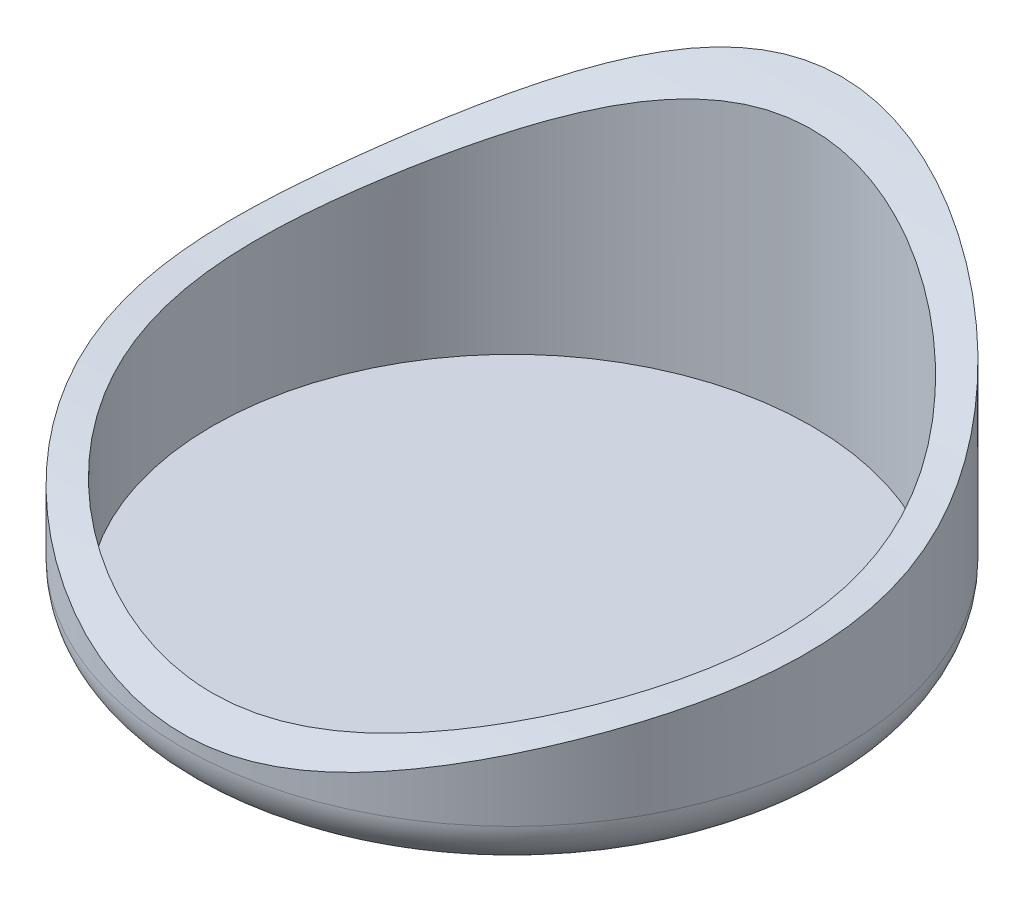
ISO-10303-21;
HEADER;
FILE_DESCRIPTION(('STEP AP214'),'2;1');
FILE_NAME('part.step','',(''),(''),'','','');
FILE_SCHEMA(('AUTOMOTIVE_DESIGN { 1 0 10303 214 1 1 1 1 }'));
ENDSEC;
DATA;
#1=APPLICATION_CONTEXT('core data for automotive mechanical design processes');
#2=APPLICATION_PROTOCOL_DEFINITION('international standard','automotive_design',2000,#1);
#3=PRODUCT_CONTEXT('',#1,'mechanical');
#4=PRODUCT('Part','Part','',(#3));
#5=PRODUCT_RELATED_PRODUCT_CATEGORY('part','',(#4));
#6=PRODUCT_DEFINITION_FORMATION('','',#4);
#7=PRODUCT_DEFINITION_CONTEXT('part definition',#1,'design');
#8=PRODUCT_DEFINITION('design','',#6,#7);
#9=PRODUCT_DEFINITION_SHAPE('','',#8);
#10=(LENGTH_UNIT() NAMED_UNIT(*) SI_UNIT(.MILLI.,.METRE.));
#11=(NAMED_UNIT(*) PLANE_ANGLE_UNIT() SI_UNIT($,.RADIAN.));
#12=(NAMED_UNIT(*) SI_UNIT($,.STERADIAN.) SOLID_ANGLE_UNIT());
#13=UNCERTAINTY_MEASURE_WITH_UNIT(LENGTH_MEASURE(1.E-05),#10,'distance_accuracy_value','');
#14=(GEOMETRIC_REPRESENTATION_CONTEXT(3) GLOBAL_UNCERTAINTY_ASSIGNED_CONTEXT((#13)) GLOBAL_UNIT_ASSIGNED_CONTEXT((#10,
#11,#12)) REPRESENTATION_CONTEXT('',''));
#15=CARTESIAN_POINT('',(0.,0.,0.));
#16=DIRECTION('',(0.,0.,1.));
#17=DIRECTION('',(1.,0.,0.));
#18=AXIS2_PLACEMENT_3D('',#15,#16,#17);
#19=CARTESIAN_POINT('',(0.,50.,0.));
#20=DIRECTION('',(0.,-1.,0.));
#21=DIRECTION('',(0.,0.,-1.));
#22=AXIS2_PLACEMENT_3D('',#19,#20,#21);
#23=CYLINDRICAL_SURFACE('',#22,55.);
#24=CARTESIAN_POINT('',(0.,8.,0.));
#25=DIRECTION('',(0.,1.,0.));
#26=DIRECTION('',(0.,0.,1.));
#27=AXIS2_PLACEMENT_3D('',#24,#25,#26);
#28=CIRCLE('',#27,55.);
#29=CARTESIAN_POINT('',(0.,8.,55.));
#30=VERTEX_POINT('',#29);
#31=EDGE_CURVE('E46',#30,#30,#28,.T.);
#32=ORIENTED_EDGE('',*,*,#31,.T.);
#33=EDGE_LOOP('',(#32));
#34=FACE_BOUND('',#33,.T.);
#35=CARTESIAN_POINT('',(0.,50.,-55.));
#36=CARTESIAN_POINT('',(0.854069115870392,49.999992625064,-54.999996191035));
#37=CARTESIAN_POINT('',(1.70831991411207,49.9777660004917,-54.9800787541194));
#38=CARTESIAN_POINT('',(3.41334942915672,49.8893770497818,-54.9006224824721));
#39=CARTESIAN_POINT('',(4.26412433642764,49.8231752633585,-54.841048062189));
#40=CARTESIAN_POINT('',(5.95779429608254,49.6484593647357,-54.6829784318823));
#41=CARTESIAN_POINT('',(6.80068813200412,49.5399388274347,-54.5844773117295));
#42=CARTESIAN_POINT('',(8.47782313889633,49.2827400179095,-54.3492966156558));
#43=CARTESIAN_POINT('',(9.3120260083913,49.1339288333599,-54.2124906262402));
#44=CARTESIAN_POINT('',(10.9659494369971,48.7996377199141,-53.9022803897119));
#45=CARTESIAN_POINT('',(11.7856723668956,48.614163855537,-53.7288821951405));
#46=CARTESIAN_POINT('',(13.4085593895451,48.2102646362606,-53.3470286634495));
#47=CARTESIAN_POINT('',(14.2117243581065,47.9918410293012,-53.1385751858987));
#48=CARTESIAN_POINT('',(15.7887838466717,47.5292334930132,-52.6913338226463));
#49=CARTESIAN_POINT('',(16.5629312999914,47.2854557145141,-52.4530145337054));
#50=CARTESIAN_POINT('',(18.0926250884293,46.7734391035743,-51.9452249696853));
#51=CARTESIAN_POINT('',(18.8481718760874,46.505200866986,-51.6757554533771));
#52=CARTESIAN_POINT('',(20.3400530494131,45.9479155637186,-51.1069426391914));
#53=CARTESIAN_POINT('',(21.0763875245413,45.6588685939571,-50.8075994804492));
#54=CARTESIAN_POINT('',(22.5292795771078,45.0635328202285,-50.1802502672315));
#55=CARTESIAN_POINT('',(23.245842999863,44.7572491954778,-49.852252806522));
#56=CARTESIAN_POINT('',(24.6592448740862,44.1306319009409,-49.1684650043946));
#57=CARTESIAN_POINT('',(25.3560839326998,43.8102986643984,-48.8126755197273));
#58=CARTESIAN_POINT('',(26.7300087740181,43.1586083349445,-48.074057042306));
#59=CARTESIAN_POINT('',(27.4070929768283,42.8272503648413,-47.6912258952254));
#60=CARTESIAN_POINT('',(29.2782875914583,41.8864853357786,-46.5804967297862));
#61=CARTESIAN_POINT('',(30.4501953752545,41.2678171093686,-45.8227342224061));
#62=CARTESIAN_POINT('',(32.7291915196127,40.0191745639058,-44.2237264055906));
#63=CARTESIAN_POINT('',(33.8362728200181,39.3891990231155,-43.3824720299668));
#64=CARTESIAN_POINT('',(35.9851198478277,38.1312499868894,-41.6173698903432));
#65=CARTESIAN_POINT('',(37.0268453400482,37.5032779463146,-40.6934720809734));
#66=CARTESIAN_POINT('',(39.0419273486149,36.2624289680221,-38.764326917331));
#67=CARTESIAN_POINT('',(40.0152851338796,35.6495517502787,-37.7590810736399));
#68=CARTESIAN_POINT('',(41.5892878261699,34.6431545535262,-36.0033498045493));
#69=CARTESIAN_POINT('',(42.2094213239966,34.2422732776303,-35.2744453649962));
#70=CARTESIAN_POINT('',(43.41478814514,33.4567419740657,-33.7798430810105));
#71=CARTESIAN_POINT('',(44.000021155523,33.072092091944,-33.0141449067797));
#72=CARTESIAN_POINT('',(45.1336837158256,32.3226652097743,-31.4465613871079));
#73=CARTESIAN_POINT('',(45.6821123756887,31.9578886903731,-30.6446751672985));
#74=CARTESIAN_POINT('',(46.739243682609,31.2522636957342,-29.0067535371727));
#75=CARTESIAN_POINT('',(47.2480013361252,30.9113821573175,-28.1707679507125));
#76=CARTESIAN_POINT('',(48.2242394638017,30.2563931325486,-26.4648544639774));
#77=CARTESIAN_POINT('',(48.6917206325427,29.9422851956661,-25.5949271352134));
#78=CARTESIAN_POINT('',(49.5827905112773,29.3442086791091,-23.8228880684401));
#79=CARTESIAN_POINT('',(50.0063826114807,29.0602377714592,-22.9207788235696));
#80=CARTESIAN_POINT('',(50.8084269172449,28.5207954417795,-21.0834732261368));
#81=CARTESIAN_POINT('',(51.1866780361525,28.2654512808639,-20.1481517191868));
#82=CARTESIAN_POINT('',(51.8932263361902,27.7833520468131,-18.251500813062));
#83=CARTESIAN_POINT('',(52.2215175500993,27.5566003893257,-17.2901683232557));
#84=CARTESIAN_POINT('',(52.8257183776272,27.129794061271,-15.3453678902753));
#85=CARTESIAN_POINT('',(53.1016273860588,26.9297396991533,-14.3618996915075));
#86=CARTESIAN_POINT('',(53.599333517663,26.5536262732468,-12.3758067045968));
#87=CARTESIAN_POINT('',(53.8210772584035,26.3775909561619,-11.3731640598427));
#88=CARTESIAN_POINT('',(54.2085382716819,26.0467345655661,-9.3536825026886));
#89=CARTESIAN_POINT('',(54.3742569247168,25.8919129693902,-8.33684394072883));
#90=CARTESIAN_POINT('',(54.648519157302,25.6000976554439,-6.29306704130976));
#91=CARTESIAN_POINT('',(54.7570653485922,25.4631031235167,-5.26612916738858));
#92=CARTESIAN_POINT('',(54.9493621996471,25.1491138797272,-2.77653790213313));
#93=CARTESIAN_POINT('',(55.003932643473,24.9792387214009,-1.31063849075073));
#94=CARTESIAN_POINT('',(54.9956251361627,24.6570605875737,1.62254910854977));
#95=CARTESIAN_POINT('',(54.9327523382722,24.5047568413751,3.08983723270951));
#96=CARTESIAN_POINT('',(54.6897797949711,24.2067816170215,6.01513112153528));
#97=CARTESIAN_POINT('',(54.5096965092104,24.0611092107126,7.47313816050201));
#98=CARTESIAN_POINT('',(54.0335084406365,23.7659055615091,10.3698621247427));
#99=CARTESIAN_POINT('',(53.7373985668483,23.6163741495595,11.8085782007091));
#100=CARTESIAN_POINT('',(53.1356666316899,23.3501024148008,14.236274730053));
#101=CARTESIAN_POINT('',(52.858586443786,23.2366917085476,15.232794792177));
#102=CARTESIAN_POINT('',(52.2490427892081,23.0003627083434,17.2077088567868));
#103=CARTESIAN_POINT('',(51.9165771037337,22.877444033599,18.1861021313492));
#104=CARTESIAN_POINT('',(51.1976708396996,22.6196147810732,20.1212322977192));
#105=CARTESIAN_POINT('',(50.8112301722722,22.4847041835476,21.0779691538673));
#106=CARTESIAN_POINT('',(49.9861537654,22.2009341664183,22.9661835959455));
#107=CARTESIAN_POINT('',(49.5475346563176,22.0520791943765,23.8976691144019));
#108=CARTESIAN_POINT('',(48.6198931015828,21.7389295705646,25.7325245926298));
#109=CARTESIAN_POINT('',(48.130870572264,21.5746348931656,26.635894505728));
#110=CARTESIAN_POINT('',(47.1045359526055,21.2297468825814,28.4115154609878));
#111=CARTESIAN_POINT('',(46.5672254795864,21.0491540952721,29.2837675440209));
#112=CARTESIAN_POINT('',(45.4551023477234,20.6743020373164,30.9814083268508));
#113=CARTESIAN_POINT('',(44.8809858562312,20.4802929308506,31.8073085770574));
#114=CARTESIAN_POINT('',(43.6903491303983,20.0765966559798,33.4239616749198));
#115=CARTESIAN_POINT('',(43.0738286769188,19.8669094065514,34.214714340902));
#116=CARTESIAN_POINT('',(41.8006802299838,19.4328213530191,35.7589788431168));
#117=CARTESIAN_POINT('',(41.1440528782554,19.2084207843301,36.5124912748597));
#118=CARTESIAN_POINT('',(39.7923991441477,18.7462583772949,37.9810704247534));
#119=CARTESIAN_POINT('',(39.0973430589127,18.5084862010798,38.6961065366005));
#120=CARTESIAN_POINT('',(37.671455038648,18.0218322554297,40.0855641657684));
#121=CARTESIAN_POINT('',(36.9406228606016,17.772950410531,40.7599854071345));
#122=CARTESIAN_POINT('',(35.4451939481835,17.2666928541381,42.0669034933099));
#123=CARTESIAN_POINT('',(34.6805966863172,17.0093170099624,42.699399682759));
#124=CARTESIAN_POINT('',(33.0969450368578,16.4816710246908,43.9389616729014));
#125=CARTESIAN_POINT('',(32.2769557261177,16.2112431458961,44.5447660066048));
#126=CARTESIAN_POINT('',(30.6049946211398,15.6685825967561,45.7096539434829));
#127=CARTESIAN_POINT('',(29.7530222098398,15.396349891673,46.268736644567));
#128=CARTESIAN_POINT('',(28.0186610057322,14.854444004396,47.3391295764531));
#129=CARTESIAN_POINT('',(27.1362692348363,14.5847710761219,47.8504351115325));
#130=CARTESIAN_POINT('',(25.3429265957072,14.0529244898544,48.8239358720299));
#131=CARTESIAN_POINT('',(24.4319837463073,13.7907487650694,49.2861447294388));
#132=CARTESIAN_POINT('',(22.5829143970834,13.2790778228051,50.1603200270973));
#133=CARTESIAN_POINT('',(21.6447902463796,13.0295815146204,50.572290793196));
#134=CARTESIAN_POINT('',(19.7430379412461,12.548829016771,51.3445757106649));
#135=CARTESIAN_POINT('',(18.7794133173613,12.3175703195693,51.7048969690511));
#136=CARTESIAN_POINT('',(16.9915345000619,11.9156476221986,52.3165860556892));
#137=CARTESIAN_POINT('',(16.1708849774303,11.7413143381406,52.5760997944323));
#138=CARTESIAN_POINT('',(14.514656234297,11.4125987848676,53.0572167329086));
#139=CARTESIAN_POINT('',(13.6790784833959,11.2582145639639,53.2788236418917));
#140=CARTESIAN_POINT('',(11.9946514135471,10.9725865415723,53.6831303098784));
#141=CARTESIAN_POINT('',(11.1458024024666,10.8413422041489,53.8658309699976));
#142=CARTESIAN_POINT('',(9.43833565310037,10.6051356559163,54.1910672962565));
#143=CARTESIAN_POINT('',(8.57973722629893,10.5001286321153,54.3336714995728));
#144=CARTESIAN_POINT('',(6.85371784863679,10.3186121254354,54.5782583540829));
#145=CARTESIAN_POINT('',(5.98629649605111,10.2421039461854,54.6802391470459));
#146=CARTESIAN_POINT('',(4.24546704219263,10.119527026275,54.8428680719409));
#147=CARTESIAN_POINT('',(3.37205920372628,10.0734569579215,54.9035180067051));
#148=CARTESIAN_POINT('',(1.61878528562685,10.0128400948417,54.9832031339637));
#149=CARTESIAN_POINT('',(0.738907321800054,9.99841842778351,55.0020731445984));
#150=CARTESIAN_POINT('',(-1.02072736531904,10.0018569897273,54.9975658432919));
#151=CARTESIAN_POINT('',(-1.90048407856056,10.0197190996378,54.9741860698053));
#152=CARTESIAN_POINT('',(-3.65659370144804,10.0872466906899,54.8853555574344));
#153=CARTESIAN_POINT('',(-4.53294676752167,10.1369106924284,54.8199067755724));
#154=CARTESIAN_POINT('',(-6.28010291912449,10.2667945152915,54.6473392722672));
#155=CARTESIAN_POINT('',(-7.15089978231031,10.3470439889023,54.5401801106351));
#156=CARTESIAN_POINT('',(-8.88335713143901,10.5360651498042,54.2849208781756));
#157=CARTESIAN_POINT('',(-9.74501732269935,10.6448377541503,54.1368194909953));
#158=CARTESIAN_POINT('',(-11.4567066230267,10.8882806318955,53.8006017387266));
#159=CARTESIAN_POINT('',(-12.3067359922906,11.0229503249247,53.6124862703688));
#160=CARTESIAN_POINT('',(-14.3623301482885,11.3791702468426,53.1063273563798));
#161=CARTESIAN_POINT('',(-15.5606961755749,11.6129505346207,52.7674508790595));
#162=CARTESIAN_POINT('',(-17.9247147863189,12.1181623602449,52.011971017356));
#163=CARTESIAN_POINT('',(-19.090360166475,12.3896021116961,51.5953506700205));
#164=CARTESIAN_POINT('',(-20.811489331001,12.8174731459881,50.9142704246939));
#165=CARTESIAN_POINT('',(-21.3808037533885,12.9635941218489,50.6778086386679));
#166=CARTESIAN_POINT('',(-22.5097744386454,13.2614845339012,50.1865415847113));
#167=CARTESIAN_POINT('',(-23.0694330736091,13.4132525530342,49.9317409039129));
#168=CARTESIAN_POINT('',(-24.7338643890204,13.8753535479539,49.1400619967048));
#169=CARTESIAN_POINT('',(-25.823997719148,14.192459536378,48.5759444546693));
#170=CARTESIAN_POINT('',(-27.5375388561711,14.7079004990671,47.6154414750163));
#171=CARTESIAN_POINT('',(-28.1744659020274,14.9034234926505,47.2413454608024));
#172=CARTESIAN_POINT('',(-29.432465248496,15.2959296496337,46.4680003026634));
#173=CARTESIAN_POINT('',(-30.0535373706331,15.4929128294383,46.0687508757676));
#174=CARTESIAN_POINT('',(-31.2791811890868,15.8866292937793,45.2455285884988));
#175=CARTESIAN_POINT('',(-31.8837521935702,16.0833625675092,44.8215546938473));
#176=CARTESIAN_POINT('',(-33.0757781285597,16.475027024464,43.9492705829832));
#177=CARTESIAN_POINT('',(-33.6632314109112,16.6699580329347,43.5009580351797));
#178=CARTESIAN_POINT('',(-34.8202798515112,17.056578671491,42.5804492788901));
#179=CARTESIAN_POINT('',(-35.3898740082778,17.2482681195236,42.1082517348771));
#180=CARTESIAN_POINT('',(-36.5103457673659,17.6270897104325,41.1405224075707));
#181=CARTESIAN_POINT('',(-37.0612252912207,17.8142223206221,40.6449930324251));
#182=CARTESIAN_POINT('',(-38.1435618268317,18.1828338765048,39.6310307513094));
#183=CARTESIAN_POINT('',(-38.6750171326413,18.3643123254115,39.1125958424334));
#184=CARTESIAN_POINT('',(-39.7175421652234,18.7206108510848,38.0535019384331));
#185=CARTESIAN_POINT('',(-40.2286129534817,18.8954312745343,37.512844103511));
#186=CARTESIAN_POINT('',(-41.4447197382046,19.3111819821526,36.172765757434));
#187=CARTESIAN_POINT('',(-42.1386835897875,19.5482220038416,35.3620282993949));
#188=CARTESIAN_POINT('',(-43.4804443348035,20.0052737414143,33.6985605588724));
#189=CARTESIAN_POINT('',(-44.1282376706105,20.2252841452087,32.8458270489646));
#190=CARTESIAN_POINT('',(-45.3748650399899,20.6472717069314,31.1009837016488));
#191=CARTESIAN_POINT('',(-45.9736987747784,20.8492487548088,30.2088736239899));
#192=CARTESIAN_POINT('',(-47.1195834515449,21.2348989193703,28.3884028005701));
#193=CARTESIAN_POINT('',(-47.6666434039877,21.4185752213247,27.4600484024712));
#194=CARTESIAN_POINT('',(-48.706532927573,21.7682016991106,25.570234302467));
#195=CARTESIAN_POINT('',(-49.1993626543734,21.9341519258214,24.6087746955946));
#196=CARTESIAN_POINT('',(-50.1284374280563,22.2496023410076,22.6563089371848));
#197=CARTESIAN_POINT('',(-50.564686302152,22.3991036420089,21.6653047896669));
#198=CARTESIAN_POINT('',(-51.2583563199886,22.6416300800625,19.9540427687576));
#199=CARTESIAN_POINT('',(-51.5305461943378,22.7382968986456,19.2402403165099));
#200=CARTESIAN_POINT('',(-52.0452101747104,22.925356911125,17.8011242988975));
#201=CARTESIAN_POINT('',(-52.2876826056578,23.0157497512531,17.0758100872524));
#202=CARTESIAN_POINT('',(-52.7423005335627,23.1912644888894,15.6152076664852));
#203=CARTESIAN_POINT('',(-52.9544494096698,23.2763869731073,14.8799205787191));
#204=CARTESIAN_POINT('',(-53.347997324022,23.442532953943,13.4006349043974));
#205=CARTESIAN_POINT('',(-53.5293936498628,23.5235560885526,12.6566355555927));
#206=CARTESIAN_POINT('',(-53.8610743909684,23.6827861766284,11.1611597673209));
#207=CARTESIAN_POINT('',(-54.0113478633303,23.7609921316077,10.4096807949955));
#208=CARTESIAN_POINT('',(-54.2803853670528,23.9159172656208,8.90095135311363));
#209=CARTESIAN_POINT('',(-54.3991493168382,23.992636440805,8.1437008686205));
#210=CARTESIAN_POINT('',(-54.6049328210034,24.1460286974508,6.62484940842192));
#211=CARTESIAN_POINT('',(-54.6919507498753,24.2227017763515,5.86324821197208));
#212=CARTESIAN_POINT('',(-54.8340700845371,24.3774872829768,4.33727923389892));
#213=CARTESIAN_POINT('',(-54.8891732218707,24.4555996323762,3.57291160463361));
#214=CARTESIAN_POINT('',(-54.9810851156884,24.6426947827262,1.77481680662594));
#215=CARTESIAN_POINT('',(-55.0047264714241,24.7529075165226,0.740515366857586));
#216=CARTESIAN_POINT('',(-54.9937115178906,24.9826038386612,-1.32672344500741));
#217=CARTESIAN_POINT('',(-54.9590552089206,25.1020874269559,-2.35966081711105));
#218=CARTESIAN_POINT('',(-54.8317958722051,25.3541495540538,-4.42038482293859));
#219=CARTESIAN_POINT('',(-54.7391923858916,25.4867281964783,-5.44817141583666));
#220=CARTESIAN_POINT('',(-54.4968224082301,25.7685478848253,-7.49374006605367));
#221=CARTESIAN_POINT('',(-54.3471074424986,25.9177738260452,-8.51153029550268));
#222=CARTESIAN_POINT('',(-53.9915523943427,26.2364366855096,-10.5340672209118));
#223=CARTESIAN_POINT('',(-53.7857122547662,26.4058736243348,-11.5388139035887));
#224=CARTESIAN_POINT('',(-53.319328225979,26.7680799347147,-13.5312938669418));
#225=CARTESIAN_POINT('',(-53.0587855309357,26.9608487968901,-14.5190275185066));
#226=CARTESIAN_POINT('',(-52.5620920153792,27.3169821661118,-16.2105202172787));
#227=CARTESIAN_POINT('',(-52.3382332886139,27.474307254433,-16.9191942304071));
#228=CARTESIAN_POINT('',(-51.8631423601903,27.8036810634934,-18.323866262331));
#229=CARTESIAN_POINT('',(-51.6119098753841,27.975729936528,-19.0198641499206));
#230=CARTESIAN_POINT('',(-51.0830663737456,28.3352084546082,-20.3976681572434));
#231=CARTESIAN_POINT('',(-50.805456644969,28.5226373485543,-21.0794749679763));
#232=CARTESIAN_POINT('',(-50.224932666494,28.9133534977363,-22.4275409672988));
#233=CARTESIAN_POINT('',(-49.9220209474938,29.1166391668475,-23.093801702295));
#234=CARTESIAN_POINT('',(-49.4495446318585,29.433673473602,-24.0806066239731));
#235=CARTESIAN_POINT('',(-49.2890220979707,29.5413774647867,-24.4074671634394));
#236=CARTESIAN_POINT('',(-48.9620872534847,29.7608244856789,-25.0568584784718));
#237=CARTESIAN_POINT('',(-48.7956749427601,29.872567515473,-25.3793892539451));
#238=CARTESIAN_POINT('',(-48.2877833345961,30.2136162097771,-26.3403686401113));
#239=CARTESIAN_POINT('',(-47.9376452452216,30.4487442427836,-26.9722128980282));
#240=CARTESIAN_POINT('',(-47.2153055166517,30.9332149511956,-28.2176046530406));
#241=CARTESIAN_POINT('',(-46.8431020978285,31.1825587730803,-28.8311506683192));
#242=CARTESIAN_POINT('',(-46.0776140128486,31.694086086304,-30.0393896509177));
#243=CARTESIAN_POINT('',(-45.6843301959714,31.956269060347,-30.6340833762181));
#244=CARTESIAN_POINT('',(-44.758656636824,32.5710696454516,-31.9766982915616));
#245=CARTESIAN_POINT('',(-44.2194237260526,32.9275714347158,-32.7181373934191));
#246=CARTESIAN_POINT('',(-43.1088473780454,33.656709495157,-34.1681322436399));
#247=CARTESIAN_POINT('',(-42.5375064632129,34.0293444983828,-34.8766905671534));
#248=CARTESIAN_POINT('',(-41.3641467434828,34.787660184785,-36.2605893160665));
#249=CARTESIAN_POINT('',(-40.7621286746782,35.1733405548656,-36.9359305377413));
#250=CARTESIAN_POINT('',(-39.5275095386878,35.9552856399836,-38.2543214791725));
#251=CARTESIAN_POINT('',(-38.8948550744557,36.3515682537161,-38.8973105215926));
#252=CARTESIAN_POINT('',(-37.6009351991512,37.1507850739798,-40.1494735395982));
#253=CARTESIAN_POINT('',(-36.9396696135666,37.5537193210731,-40.7586473088774));
#254=CARTESIAN_POINT('',(-35.5892055641678,38.3628940588503,-41.9429987778972));
#255=CARTESIAN_POINT('',(-34.9000045451433,38.76913484925,-42.5181733559024));
#256=CARTESIAN_POINT('',(-33.3543615908339,39.6621884633753,-43.745222189444));
#257=CARTESIAN_POINT('',(-32.4919215891232,40.1489552890134,-44.3895966609254));
#258=CARTESIAN_POINT('',(-30.7280595199283,41.1157902618846,-45.6283681494319));
#259=CARTESIAN_POINT('',(-29.826632274882,41.5958575081378,-46.2227584974418));
#260=CARTESIAN_POINT('',(-27.9847680204105,42.5424339950318,-47.3605840161798));
#261=CARTESIAN_POINT('',(-27.0443182562064,43.0089387165755,-47.9040023340746));
#262=CARTESIAN_POINT('',(-25.1263128390318,43.9198437850056,-48.937235031649));
#263=CARTESIAN_POINT('',(-24.1488200243353,44.3642788492797,-49.4271351574015));
#264=CARTESIAN_POINT('',(-22.1558032859289,45.2233394241871,-50.3520303040028));
#265=CARTESIAN_POINT('',(-21.1402902190651,45.6379733473994,-50.7870408460675));
#266=CARTESIAN_POINT('',(-19.0721543305148,46.428167059024,-51.5992829685869));
#267=CARTESIAN_POINT('',(-18.0195535831354,46.803749581607,-51.9765482271311));
#268=CARTESIAN_POINT('',(-16.2574638179544,47.3818525248241,-52.5473460465424));
#269=CARTESIAN_POINT('',(-15.558339885769,47.5985891452374,-52.7586594120585));
#270=CARTESIAN_POINT('',(-14.1459477814543,48.0089487427808,-53.1547736085202));
#271=CARTESIAN_POINT('',(-13.4326809093402,48.2025738329368,-53.339576863527));
#272=CARTESIAN_POINT('',(-11.9929807140362,48.564005846863,-53.6816160424518));
#273=CARTESIAN_POINT('',(-11.2665456897086,48.7318094079037,-53.8388483761888));
#274=CARTESIAN_POINT('',(-9.80443748580677,49.0384479526978,-54.1241715621028));
#275=CARTESIAN_POINT('',(-9.06880179463937,49.1773748950343,-54.2523550428501));
#276=CARTESIAN_POINT('',(-7.58794368340024,49.4245641887451,-54.4792081303766));
#277=CARTESIAN_POINT('',(-6.84272231803851,49.5328298841039,-54.57788095572));
#278=CARTESIAN_POINT('',(-5.34534667223215,49.7166704791994,-54.7448109916503));
#279=CARTESIAN_POINT('',(-4.59319727535835,49.7922668387327,-54.8130881693875));
#280=CARTESIAN_POINT('',(-3.20123558454131,49.9003163337452,-54.9104762710546));
#281=CARTESIAN_POINT('',(-2.5621109190416,49.9376452647518,-54.9440219876641));
#282=CARTESIAN_POINT('',(-1.6021208950689,49.975028146579,-54.9775935784364));
#283=CARTESIAN_POINT('',(-1.28187493528355,49.9843873597677,-54.9859929469241));
#284=CARTESIAN_POINT('',(-0.641094548679899,49.9968754073273,-54.9971975341));
#285=CARTESIAN_POINT('',(-0.320560071559227,50.0000027680547,-55.0000014296291));
#286=CARTESIAN_POINT('',(0.,50.,-55.));
#287=B_SPLINE_CURVE_WITH_KNOTS('',3,(#35,#36,#37,#38,#39,#40,#41,#42,#43,#44,#45,#46,#47,#48,
#49,#50,#51,#52,#53,#54,#55,#56,#57,#58,#59,#60,#61,#62,#63,#64,#65,#66,#67,#68,#69,#70,#71,#72,
#73,#74,#75,#76,#77,#78,#79,#80,#81,#82,#83,#84,#85,#86,#87,#88,#89,#90,#91,#92,#93,#94,#95,#96,
#97,#98,#99,#100,#101,#102,#103,#104,#105,#106,#107,#108,#109,#110,#111,#112,#113,#114,#115,
#116,#117,#118,#119,#120,#121,#122,#123,#124,#125,#126,#127,#128,#129,#130,#131,#132,#133,#134,
#135,#136,#137,#138,#139,#140,#141,#142,#143,#144,#145,#146,#147,#148,#149,#150,#151,#152,#153,
#154,#155,#156,#157,#158,#159,#160,#161,#162,#163,#164,#165,#166,#167,#168,#169,#170,#171,#172,
#173,#174,#175,#176,#177,#178,#179,#180,#181,#182,#183,#184,#185,#186,#187,#188,#189,#190,#191,
#192,#193,#194,#195,#196,#197,#198,#199,#200,#201,#202,#203,#204,#205,#206,#207,#208,#209,#210,
#211,#212,#213,#214,#215,#216,#217,#218,#219,#220,#221,#222,#223,#224,#225,#226,#227,#228,#229,
#230,#231,#232,#233,#234,#235,#236,#237,#238,#239,#240,#241,#242,#243,#244,#245,#246,#247,#248,
#249,#250,#251,#252,#253,#254,#255,#256,#257,#258,#259,#260,#261,#262,#263,#264,#265,#266,#267,
#268,#269,#270,#271,#272,#273,#274,#275,#276,#277,#278,#279,#280,#281,#282,#283,#284,#285,#286),
.UNSPECIFIED.,.T.,.F.,(4,2,2,2,2,2,2,2,2,2,2,2,2,2,2,2,2,2,2,2,2,2,2,2,2,2,2,2,2,2,2,2,2,2,2,2,
2,2,2,2,2,2,2,2,2,2,2,2,2,2,2,2,2,2,2,2,2,2,2,2,2,2,2,2,2,2,2,2,2,2,2,2,2,2,2,2,2,2,2,2,2,2,2,2,
2,2,2,2,2,2,2,2,2,2,2,2,2,2,2,2,2,2,2,2,2,2,2,2,2,2,2,2,2,2,2,2,2,2,2,2,2,2,2,2,2,4),(0.,
2.56200694969996,5.12631597945433,7.69101449057014,10.2642788412174,12.837117893675,
15.4098205084209,17.9462878776894,20.4826934755588,23.0190872607623,25.5547229457728,
28.0902804950225,30.6260402727003,35.2014980365665,39.7774531835112,44.3561983410306,
48.9348584936522,52.0463801870225,55.1579297755065,58.2695545849186,61.3767852295016,
64.4839635771278,67.5909017316199,70.7111457601362,73.8317621792123,76.9524146495025,
80.0761303726221,83.1997691196147,86.3232651608412,90.7483241103604,95.1731888990267,
99.597432446227,104.021870140623,107.141895935076,110.262046751068,113.382202704337,
116.501366849569,119.620536172494,122.73960106318,125.811140690785,128.882696192951,
131.954202561819,135.02811712448,138.102052570259,141.176036055573,144.33877143327,
147.501567862228,150.66467481667,153.826901206827,156.988855114747,160.150373516608,
162.78383163566,165.417031918611,168.050171206829,170.67878190249,173.307512824504,
175.936129075193,178.575119451227,181.214263584351,183.853284955135,186.494871381173,
189.13654274799,191.778154920197,195.57577560303,199.374225860477,201.27455386043,
203.174408169763,206.974430271241,209.266263231259,211.558121978537,213.85007666815,
216.142251310898,218.434554262324,220.726621134762,223.018888828336,225.311037000091,
228.588623990354,231.866463259607,235.144322530927,238.421610285994,241.698888633961,
244.975945186196,247.285399856238,249.594984642948,251.904311856702,254.213842649463,
256.524184107791,258.834531547311,261.144997268151,263.455337622453,266.574875215355,
269.694412792239,272.813975056051,275.93072950143,279.047487120598,282.164176707411,
284.442466618957,286.720780098843,288.998982381053,291.2769570703,292.416109755935,
293.555262466008,295.833538164492,298.111997862649,300.39036583593,303.340055748488,
306.289514256601,309.238902026259,312.193629650937,315.14837530038,318.103391828386,
321.646175668494,325.189431448773,328.733854633107,332.27251302634,335.810168534258,
339.345752891053,341.63045360668,343.914945277941,346.199734206498,348.477131733261,
350.754280786199,353.02993174593,354.952302242228,355.913679931384,356.875284930172),.UNSPECIFIED.);
#288=CARTESIAN_POINT('',(0.,50.,-55.));
#289=VERTEX_POINT('',#288);
#290=EDGE_CURVE('E69',#289,#289,#287,.T.);
#291=ORIENTED_EDGE('',*,*,#290,.T.);
#292=EDGE_LOOP('',(#291));
#293=FACE_BOUND('',#292,.T.);
#294=ADVANCED_FACE('F38',(#34,#293),#23,.T.);
#295=CARTESIAN_POINT('',(0.,0.,0.));
#296=DIRECTION('',(0.,1.,0.));
#297=DIRECTION('',(0.,0.,1.));
#298=AXIS2_PLACEMENT_3D('',#295,#296,#297);
#299=PLANE('',#298);
#300=CARTESIAN_POINT('',(0.,0.,0.));
#301=DIRECTION('',(0.,1.,0.));
#302=DIRECTION('',(0.,0.,1.));
#303=AXIS2_PLACEMENT_3D('',#300,#301,#302);
#304=CIRCLE('',#303,47.);
#305=CARTESIAN_POINT('',(0.,0.,47.));
#306=VERTEX_POINT('',#305);
#307=EDGE_CURVE('E10',#306,#306,#304,.F.);
#308=ORIENTED_EDGE('',*,*,#307,.T.);
#309=EDGE_LOOP('',(#308));
#310=FACE_BOUND('',#309,.T.);
#311=CARTESIAN_POINT('',(0.,0.,0.));
#312=DIRECTION('',(0.,-1.,0.));
#313=DIRECTION('',(0.,0.,-1.));
#314=AXIS2_PLACEMENT_3D('',#311,#312,#313);
#315=CIRCLE('',#314,45.);
#316=CARTESIAN_POINT('',(0.,0.,-45.));
#317=VERTEX_POINT('',#316);
#318=EDGE_CURVE('E52',#317,#317,#315,.T.);
#319=ORIENTED_EDGE('',*,*,#318,.F.);
#320=EDGE_LOOP('',(#319));
#321=FACE_BOUND('',#320,.T.);
#322=ADVANCED_FACE('F82',(#310,#321),#299,.F.);
#323=CARTESIAN_POINT('',(-64.,10.,55.));
#324=CARTESIAN_POINT('',(-64.,27.4052914409848,32.1855750526101));
#325=CARTESIAN_POINT('',(-64.,18.2029956521843,-13.1906804716222));
#326=CARTESIAN_POINT('',(-64.,40.2895559548534,-46.2899029569435));
#327=CARTESIAN_POINT('',(-64.,50.,-55.));
#328=B_SPLINE_CURVE_WITH_KNOTS('',3,(#323,#324,#325,#326,#327),.UNSPECIFIED.,.F.,.F.,(4,1,4),
(0.,0.690633178431917,1.),.UNSPECIFIED.);
#329=DIRECTION('',(1.,0.,0.));
#330=VECTOR('',#329,1.);
#331=SURFACE_OF_LINEAR_EXTRUSION('',#328,#330);
#332=CARTESIAN_POINT('',(0.,13.3717940304652,50.));
#333=CARTESIAN_POINT('',(0.881159904057266,13.371795840602,49.9999989948074));
#334=CARTESIAN_POINT('',(1.7623426963259,13.385650150989,49.9766925835683));
#335=CARTESIAN_POINT('',(3.5217000198749,13.4406999602166,49.8836042952436));
#336=CARTESIAN_POINT('',(4.3998733139764,13.4819055994411,49.8138051811607));
#337=CARTESIAN_POINT('',(6.14974348791959,13.5905511566519,49.6281657633903));
#338=CARTESIAN_POINT('',(7.02143999255763,13.6579925825996,49.5123228132203));
#339=CARTESIAN_POINT('',(8.75680116328075,13.817475712535,49.2350675746496));
#340=CARTESIAN_POINT('',(9.62044954693586,13.9095592837089,49.0735777052796));
#341=CARTESIAN_POINT('',(11.3354337356374,14.1159526960125,48.7060262816744));
#342=CARTESIAN_POINT('',(12.186770327416,14.2302611101564,48.4999675889644));
#343=CARTESIAN_POINT('',(13.8747733772549,14.4783972228069,48.0443017372284));
#344=CARTESIAN_POINT('',(14.7114401279356,14.6122245314712,47.7946954479394));
#345=CARTESIAN_POINT('',(16.3629034134784,14.8955606120751,47.2546875169916));
#346=CARTESIAN_POINT('',(17.1778030946128,15.0449674475855,46.9645473054784));
#347=CARTESIAN_POINT('',(18.7892339786063,15.3571047205318,46.343395787129));
#348=CARTESIAN_POINT('',(19.5857654137126,15.5198349893884,46.012384997395));
#349=CARTESIAN_POINT('',(21.1588480333882,15.8555722677573,45.3105391511795));
#350=CARTESIAN_POINT('',(21.9353992462723,16.0285792627049,44.9397041511381));
#351=CARTESIAN_POINT('',(23.4670561811651,16.3818923466211,44.1592130205151));
#352=CARTESIAN_POINT('',(24.2221611848834,16.5621986795744,43.7495555916556));
#353=CARTESIAN_POINT('',(25.7094722552607,16.9272483757996,42.8924202745448));
#354=CARTESIAN_POINT('',(26.441678515926,17.1119917014561,42.4449427068384));
#355=CARTESIAN_POINT('',(27.8818376991189,17.4832504331645,41.5131157869079));
#356=CARTESIAN_POINT('',(28.5897889594523,17.6697659595509,41.0287639149889));
#357=CARTESIAN_POINT('',(30.0430565351874,18.0589894261693,39.9786152280632));
#358=CARTESIAN_POINT('',(30.7859355898309,18.2616312012393,39.4094160361218));
#359=CARTESIAN_POINT('',(32.239218680302,18.6632234350488,38.2296844817774));
#360=CARTESIAN_POINT('',(32.9496210868183,18.8621737082936,37.6191500494429));
#361=CARTESIAN_POINT('',(34.3359513152304,19.2539099221466,36.3582231570168));
#362=CARTESIAN_POINT('',(35.0118785644185,19.4466957603303,35.7078300351801));
#363=CARTESIAN_POINT('',(36.3270282125542,19.8240096143397,34.3689876717462));
#364=CARTESIAN_POINT('',(36.9662596311479,20.0085396569157,33.6805478641885));
#365=CARTESIAN_POINT('',(38.2060932677208,20.3678071373287,32.2672903084806));
#366=CARTESIAN_POINT('',(38.8066958632192,20.5425446708657,31.5424729159716));
#367=CARTESIAN_POINT('',(39.9671604162291,20.8811252321389,30.0584975866534));
#368=CARTESIAN_POINT('',(40.5270227860299,21.0449683701244,29.2993399974917));
#369=CARTESIAN_POINT('',(41.6079677786925,21.3623425560972,27.7431299218719));
#370=CARTESIAN_POINT('',(42.1287287166842,21.5157872246542,26.9458362948035));
#371=CARTESIAN_POINT('',(43.1247624782332,21.8109122452648,25.3211919264194));
#372=CARTESIAN_POINT('',(43.600034132606,21.9525922949269,24.4938404132968));
#373=CARTESIAN_POINT('',(44.5031568793908,22.2245992837559,22.8118435316973));
#374=CARTESIAN_POINT('',(44.9310081555184,22.3549262669063,21.9571982689779));
#375=CARTESIAN_POINT('',(45.7376016716025,22.6051567736086,20.223403813377));
#376=CARTESIAN_POINT('',(46.1163369427169,22.7250588172206,19.3442511647092));
#377=CARTESIAN_POINT('',(46.8230750787552,22.9557934427993,17.5646324963185));
#378=CARTESIAN_POINT('',(47.1510778157871,23.0666260019025,16.664166422873));
#379=CARTESIAN_POINT('',(47.7550185141439,23.2810169601368,14.8450842730665));
#380=CARTESIAN_POINT('',(48.0309577161712,23.3845755325741,13.926468629796));
#381=CARTESIAN_POINT('',(48.4623654252429,23.5593213328721,12.3243492033098));
#382=CARTESIAN_POINT('',(48.6302498624363,23.6317033771978,11.6442882663425));
#383=CARTESIAN_POINT('',(48.9373478677115,23.7747033567012,10.2774788422307));
#384=CARTESIAN_POINT('',(49.0765597171022,23.8453211859057,9.5907299567801));
#385=CARTESIAN_POINT('',(49.3259985951531,23.9857989367346,8.21198100541064));
#386=CARTESIAN_POINT('',(49.4362282322925,24.0556589260238,7.51998141784128));
#387=CARTESIAN_POINT('',(49.6275150977584,24.1957150517823,6.13193263990898));
#388=CARTESIAN_POINT('',(49.7085697958679,24.265911216872,5.43588310362823));
#389=CARTESIAN_POINT('',(49.8413506324276,24.407762804142,4.04110706841308));
#390=CARTESIAN_POINT('',(49.8930754212833,24.4794182933149,3.34238044778369));
#391=CARTESIAN_POINT('',(49.9671166056349,24.6253412506818,1.94364342153614));
#392=CARTESIAN_POINT('',(49.989433019316,24.6996087172607,1.24363301671209));
#393=CARTESIAN_POINT('',(50.0046556480736,24.851929199503,-0.156328286149594));
#394=CARTESIAN_POINT('',(49.9975607706415,24.9299823556829,-0.856279181010871));
#395=CARTESIAN_POINT('',(49.954038336407,25.091030441892,-2.25464285893142));
#396=CARTESIAN_POINT('',(49.9176124656296,25.1740250876169,-2.95305572808672));
#397=CARTESIAN_POINT('',(49.7979559941258,25.3758311176561,-4.58773555126212));
#398=CARTESIAN_POINT('',(49.7029068000531,25.4971143443027,-5.5228596984898));
#399=CARTESIAN_POINT('',(49.4606059412743,25.7533916407167,-7.38441502558667));
#400=CARTESIAN_POINT('',(49.3133536838689,25.8883858661427,-8.31084610663458));
#401=CARTESIAN_POINT('',(48.9675640070017,26.1745548809643,-10.1515810859048));
#402=CARTESIAN_POINT('',(48.7690263165066,26.325729755869,-11.0658849200102));
#403=CARTESIAN_POINT('',(48.322078244987,26.6462991197353,-12.8781626827928));
#404=CARTESIAN_POINT('',(48.0737089345763,26.8156785516918,-13.7761493994778));
#405=CARTESIAN_POINT('',(47.5285343111901,27.174553305187,-15.5532059697987));
#406=CARTESIAN_POINT('',(47.2317289565541,27.3640486440277,-16.4322758071633));
#407=CARTESIAN_POINT('',(46.5915404112413,27.7644944870704,-18.1682173272489));
#408=CARTESIAN_POINT('',(46.2481606896468,27.9754433930154,-19.0250906576163));
#409=CARTESIAN_POINT('',(45.5299568725734,28.4117353958133,-20.6835760028558));
#410=CARTESIAN_POINT('',(45.1566905309069,28.6362970543313,-21.4860690271899));
#411=CARTESIAN_POINT('',(44.3708593875994,29.106467622663,-23.0652250683779));
#412=CARTESIAN_POINT('',(43.9582947709994,29.3520764333728,-23.8418882068321));
#413=CARTESIAN_POINT('',(43.0960920323693,29.8641526595522,-25.3671936610255));
#414=CARTESIAN_POINT('',(42.6464550938497,30.1306194091315,-26.1158368701749));
#415=CARTESIAN_POINT('',(41.7115875820135,30.6820120616772,-27.5844483844139));
#416=CARTESIAN_POINT('',(41.2263274632435,30.9669532637344,-28.3043921052159));
#417=CARTESIAN_POINT('',(40.2222578398309,31.5523415378695,-29.7139494096122));
#418=CARTESIAN_POINT('',(39.70344721251,31.8527891287593,-30.4035619769566));
#419=CARTESIAN_POINT('',(38.6338315607366,32.4663351522566,-31.751653044839));
#420=CARTESIAN_POINT('',(38.0830254007144,32.7794340337571,-32.4101304388365));
#421=CARTESIAN_POINT('',(36.9274261532306,33.4284612051602,-33.7218089580227));
#422=CARTESIAN_POINT('',(36.3213432028991,33.764798403932,-34.3736710664355));
#423=CARTESIAN_POINT('',(35.077296430032,34.4445769421988,-35.6422861045297));
#424=CARTESIAN_POINT('',(34.4393328415623,34.7880182295251,-36.2590392919078));
#425=CARTESIAN_POINT('',(33.1325631483208,35.4784997404933,-37.4568943475395));
#426=CARTESIAN_POINT('',(32.4637554271944,35.8255401520033,-38.0379943436975));
#427=CARTESIAN_POINT('',(31.0959458023609,36.5196659793836,-39.1641065328061));
#428=CARTESIAN_POINT('',(30.3969323531423,36.8667513609915,-39.7091047213391));
#429=CARTESIAN_POINT('',(28.9696886933426,37.5569747771655,-40.7620348600563));
#430=CARTESIAN_POINT('',(28.2414599756113,37.900113012274,-41.2699687004353));
#431=CARTESIAN_POINT('',(26.7564325626588,38.5783676111528,-42.2478845786381));
#432=CARTESIAN_POINT('',(25.9996351348172,38.9134843297024,-42.7178682971276));
#433=CARTESIAN_POINT('',(24.1759105324829,39.6918102430532,-43.7836994486204));
#434=CARTESIAN_POINT('',(23.0967863140946,40.1297281605363,-44.3627159224655));
#435=CARTESIAN_POINT('',(20.8879446230245,40.9708753085084,-45.4445412697716));
#436=CARTESIAN_POINT('',(19.7582267685769,41.3741042771769,-45.9473495680609));
#437=CARTESIAN_POINT('',(17.4521941645482,42.1327122282571,-46.8717464233338));
#438=CARTESIAN_POINT('',(16.275951956424,42.4881621756481,-47.2934558448437));
#439=CARTESIAN_POINT('',(14.4793060782415,42.9759871717915,-47.8617229936176));
#440=CARTESIAN_POINT('',(13.8750186411131,43.1310425277587,-48.0404351299607));
#441=CARTESIAN_POINT('',(12.6563713860658,43.4244494348904,-48.375773793945));
#442=CARTESIAN_POINT('',(12.0420127583361,43.562802943905,-48.5324029105987));
#443=CARTESIAN_POINT('',(10.7473822842008,43.8330948358131,-48.836210450025));
#444=CARTESIAN_POINT('',(10.0662301620599,43.9632829856605,-48.9812068886542));
#445=CARTESIAN_POINT('',(8.69453011582219,44.1999988695229,-49.2431988046534));
#446=CARTESIAN_POINT('',(8.00398293190569,44.3065284561288,-49.3601964745312));
#447=CARTESIAN_POINT('',(6.61523005773897,44.4942807279114,-49.5654251387153));
#448=CARTESIAN_POINT('',(5.9170247501542,44.5755046716649,-49.6536575636717));
#449=CARTESIAN_POINT('',(4.51555960140028,44.7112571780691,-49.8006595079274));
#450=CARTESIAN_POINT('',(3.81230482163122,44.7658094766536,-49.8594552249998));
#451=CARTESIAN_POINT('',(2.40229233968243,44.847396219645,-49.9472518748881));
#452=CARTESIAN_POINT('',(1.69553441885064,44.8744289240904,-49.9762509237725));
#453=CARTESIAN_POINT('',(0.280928396059877,44.900495525866,-50.0042151420649));
#454=CARTESIAN_POINT('',(-0.426919670061328,44.8995303247583,-50.0031812785642));
#455=CARTESIAN_POINT('',(-1.84156537495623,44.8696156177325,-49.9710852886617));
#456=CARTESIAN_POINT('',(-2.54836260535386,44.8406571614836,-49.9400135582018));
#457=CARTESIAN_POINT('',(-3.95835868466197,44.7552495141532,-49.8480747993539));
#458=CARTESIAN_POINT('',(-4.66155742878993,44.6987995271107,-49.7872069082789));
#459=CARTESIAN_POINT('',(-6.06209267629689,44.5593765795849,-49.6361471310166));
#460=CARTESIAN_POINT('',(-6.75942952456706,44.4764051908871,-49.5459569826015));
#461=CARTESIAN_POINT('',(-8.14706719981327,44.2851892336162,-49.3367834531937));
#462=CARTESIAN_POINT('',(-8.83735926906401,44.1769164554519,-49.2177679281295));
#463=CARTESIAN_POINT('',(-10.2084032791291,43.9368186092988,-48.9517738297878));
#464=CARTESIAN_POINT('',(-10.8891548356413,43.804992595484,-48.8047941335392));
#465=CARTESIAN_POINT('',(-12.2396718114068,43.5196884325887,-48.48373231203));
#466=CARTESIAN_POINT('',(-12.9094361188377,43.3662081071672,-48.3096474624156));
#467=CARTESIAN_POINT('',(-14.4306776719156,42.9919277496954,-47.8805740771297));
#468=CARTESIAN_POINT('',(-15.2780772336574,42.764560022657,-47.6168079190414));
#469=CARTESIAN_POINT('',(-16.9506253412689,42.281637655044,-47.0473919163531));
#470=CARTESIAN_POINT('',(-17.7757682038546,42.0260758983085,-46.7417314929184));
#471=CARTESIAN_POINT('',(-19.4022968988239,41.4913812018962,-46.0903291070142));
#472=CARTESIAN_POINT('',(-20.2036805691709,41.2122461259373,-45.7445835108499));
#473=CARTESIAN_POINT('',(-21.7827301003573,40.634490669958,-45.0141148091133));
#474=CARTESIAN_POINT('',(-22.5603610148855,40.3358434346997,-44.6293375628898));
#475=CARTESIAN_POINT('',(-24.0899246038533,39.7237379794033,-43.8226316164185));
#476=CARTESIAN_POINT('',(-24.8418604847248,39.4102816190831,-43.400707575319));
#477=CARTESIAN_POINT('',(-26.3195910783145,38.7725682319847,-42.5208023855962));
#478=CARTESIAN_POINT('',(-27.0453852865131,38.4483109969879,-42.0628205416203));
#479=CARTESIAN_POINT('',(-28.4857994571134,37.7856962513312,-41.1014017414242));
#480=CARTESIAN_POINT('',(-29.1998336218891,37.4471854536077,-40.5971931420824));
#481=CARTESIAN_POINT('',(-30.5994700712057,36.7667397328512,-39.5529364761607));
#482=CARTESIAN_POINT('',(-31.2850726950256,36.4248048507388,-39.012888837455));
#483=CARTESIAN_POINT('',(-32.6271619401389,35.7411627726536,-37.8976193128604));
#484=CARTESIAN_POINT('',(-33.2836486393563,35.3994555760738,-37.322397521119));
#485=CARTESIAN_POINT('',(-34.5664076491654,34.7198942499107,-36.1375906477696));
#486=CARTESIAN_POINT('',(-35.192691531217,34.3820386831689,-35.5280189237362));
#487=CARTESIAN_POINT('',(-36.4142749175748,33.7134052385645,-34.2748632230742));
#488=CARTESIAN_POINT('',(-37.0095740577606,33.3826274439039,-33.6312788469214));
#489=CARTESIAN_POINT('',(-38.1680251630424,32.7313512737097,-32.310578689855));
#490=CARTESIAN_POINT('',(-38.7311718831145,32.4108545790469,-31.6334574715309));
#491=CARTESIAN_POINT('',(-39.7458602687493,31.8280829100909,-30.3453393058998));
#492=CARTESIAN_POINT('',(-40.2018710743704,31.5640188725959,-29.7386673204219));
#493=CARTESIAN_POINT('',(-41.0880708465286,31.0477334313343,-28.5017425553967));
#494=CARTESIAN_POINT('',(-41.5182569035895,30.7955133626313,-27.8714871318205));
#495=CARTESIAN_POINT('',(-42.3515826137075,30.3048268163748,-26.5881311127941));
#496=CARTESIAN_POINT('',(-42.7547233152893,30.0663598056776,-25.9350314044919));
#497=CARTESIAN_POINT('',(-43.3381806872002,29.7203854105796,-24.9389293831928));
#498=CARTESIAN_POINT('',(-43.5291307476896,29.6070110605406,-24.6041408400498));
#499=CARTESIAN_POINT('',(-43.9037845120425,29.3843241562677,-23.9292016080555));
#500=CARTESIAN_POINT('',(-44.087488212156,29.2750116041357,-23.5890509164294));
#501=CARTESIAN_POINT('',(-44.6271463993808,28.9533516372721,-22.5613860797181));
#502=CARTESIAN_POINT('',(-44.9719905474925,28.7470790087786,-21.8660748227506));
#503=CARTESIAN_POINT('',(-45.6305288611824,28.3507457590568,-20.4563007818557));
#504=CARTESIAN_POINT('',(-45.9442203008617,28.1606865567272,-19.7418363289351));
#505=CARTESIAN_POINT('',(-46.5390641572231,27.7964580610553,-18.2955412863801));
#506=CARTESIAN_POINT('',(-46.8202178199622,27.6222881592753,-17.5637113630628));
#507=CARTESIAN_POINT('',(-47.3487086447321,27.289259019754,-16.0846658412487));
#508=CARTESIAN_POINT('',(-47.5960507840265,27.1303975295388,-15.3374525259549));
#509=CARTESIAN_POINT('',(-48.0926341665638,26.8028503441499,-13.7089140854948));
#510=CARTESIAN_POINT('',(-48.3358579241377,26.6366539946756,-12.8252453098025));
#511=CARTESIAN_POINT('',(-48.7739045503451,26.3219822713145,-11.0430188110785));
#512=CARTESIAN_POINT('',(-48.9687329482847,26.1735048739957,-10.14446280148));
#513=CARTESIAN_POINT('',(-49.3088614380797,25.8921853653681,-8.33564654972096));
#514=CARTESIAN_POINT('',(-49.4541634829755,25.7593426376514,-7.42538677056047));
#515=CARTESIAN_POINT('',(-49.6944249670536,25.5068963662804,-5.59603437159989));
#516=CARTESIAN_POINT('',(-49.7893627645491,25.3872985314388,-4.67693812716973));
#517=CARTESIAN_POINT('',(-49.9282023721074,25.1588636710964,-2.83353477494385));
#518=CARTESIAN_POINT('',(-49.9721026423137,25.0500269703611,-1.90922751077151));
#519=CARTESIAN_POINT('',(-50.0085312000005,24.8404640701907,-0.0587299308744405));
#520=CARTESIAN_POINT('',(-50.0010591346996,24.7397379264568,0.867460397737903));
#521=CARTESIAN_POINT('',(-49.9183591473424,24.4956872643072,3.1716988159536));
#522=CARTESIAN_POINT('',(-49.8117639235018,24.3556376988089,4.54907284230877));
#523=CARTESIAN_POINT('',(-49.4848721646784,24.0786562912049,7.2906088078473));
#524=CARTESIAN_POINT('',(-49.2645776927549,23.9417243925765,8.65477098630052));
#525=CARTESIAN_POINT('',(-48.8502743101203,23.7325409120797,10.6830412824976));
#526=CARTESIAN_POINT('',(-48.6981914773657,23.6621803740487,11.356152177487));
#527=CARTESIAN_POINT('',(-48.3663703732662,23.5192572976425,12.695268420419));
#528=CARTESIAN_POINT('',(-48.186634459441,23.4466949474021,13.3612743689116));
#529=CARTESIAN_POINT('',(-47.7998512558804,23.2984939769631,14.6850187913806));
#530=CARTESIAN_POINT('',(-47.5928015924743,23.222855089797,15.342756541371));
#531=CARTESIAN_POINT('',(-47.1518536709958,23.0677404325143,16.6486532275586));
#532=CARTESIAN_POINT('',(-46.9179569982114,22.9882648891087,17.2968127267929));
#533=CARTESIAN_POINT('',(-46.3335610092776,22.7949426929169,18.8171388358359));
#534=CARTESIAN_POINT('',(-45.9716650936447,22.6791397980353,19.6847055750769));
#535=CARTESIAN_POINT('',(-45.2001416688395,22.4377113484679,21.3969405904551));
#536=CARTESIAN_POINT('',(-44.7905129495695,22.3120855447834,22.241608285398));
#537=CARTESIAN_POINT('',(-43.9251382348654,22.0500503423052,23.9052576420103));
#538=CARTESIAN_POINT('',(-43.4693925809732,21.9136410233759,24.7242394938502));
#539=CARTESIAN_POINT('',(-42.5136106714984,21.629545291139,26.3337975981586));
#540=CARTESIAN_POINT('',(-42.0135787681211,21.4818599861687,27.1243766311879));
#541=CARTESIAN_POINT('',(-40.9710899630621,21.1751671988063,28.6747699176254));
#542=CARTESIAN_POINT('',(-40.428632810072,21.0161596493468,29.4345839887553));
#543=CARTESIAN_POINT('',(-39.3033008877198,20.6872765687477,30.9211841598699));
#544=CARTESIAN_POINT('',(-38.7204268144003,20.5174012247727,31.6479708282817));
#545=CARTESIAN_POINT('',(-37.5214844599363,20.1692194588402,33.060382798437));
#546=CARTESIAN_POINT('',(-36.9057456031213,19.990998330046,33.7463088945706));
#547=CARTESIAN_POINT('',(-35.6385284632493,19.6261484765918,35.0819433001732));
#548=CARTESIAN_POINT('',(-34.9870502411337,19.4395197662682,35.7316516713955));
#549=CARTESIAN_POINT('',(-33.6503048039088,19.0596447484048,36.9932649144683));
#550=CARTESIAN_POINT('',(-32.9650375384337,18.866398431001,37.6051697299659));
#551=CARTESIAN_POINT('',(-31.5618419311172,18.475269962068,38.7903918358943));
#552=CARTESIAN_POINT('',(-30.8438788408147,18.2773829922069,39.3636663875209));
#553=CARTESIAN_POINT('',(-29.3778133942067,17.8797530456985,40.4695834796259));
#554=CARTESIAN_POINT('',(-28.6297111776571,17.6800100776608,41.0022262084821));
#555=CARTESIAN_POINT('',(-27.1051095763524,17.2815785615961,42.0256592006981));
#556=CARTESIAN_POINT('',(-26.3286094562899,17.0828900410247,42.5164483792454));
#557=CARTESIAN_POINT('',(-24.7186055346662,16.6822329497915,43.4729875149169));
#558=CARTESIAN_POINT('',(-23.8840577943303,16.4804314332741,43.9370521111528));
#559=CARTESIAN_POINT('',(-22.1881269894401,16.0853058039185,44.8174057445038));
#560=CARTESIAN_POINT('',(-21.3267428085179,15.8919820445536,45.2336927907398));
#561=CARTESIAN_POINT('',(-19.5790638811826,15.5178790378025,46.0171427072445));
#562=CARTESIAN_POINT('',(-18.6927651269682,15.3371018250883,46.3842976186789));
#563=CARTESIAN_POINT('',(-16.8996649059526,14.9927127203166,47.0671813924136));
#564=CARTESIAN_POINT('',(-15.9929146759777,14.8290627087898,47.3830253608975));
#565=CARTESIAN_POINT('',(-14.1596335527318,14.5226086680617,47.9627864786377));
#566=CARTESIAN_POINT('',(-13.2331056680957,14.3798014937285,48.2267114644339));
#567=CARTESIAN_POINT('',(-11.3634653849017,14.1189739552537,48.7011415646349));
#568=CARTESIAN_POINT('',(-10.4203613963145,14.0009413937916,48.9116729770577));
#569=CARTESIAN_POINT('',(-8.69368772911399,13.8119831750362,49.2447539174206));
#570=CARTESIAN_POINT('',(-7.91235994193899,13.7363929262771,49.3763448264629));
#571=CARTESIAN_POINT('',(-6.34267245089974,13.6056051840308,49.6024107299179));
#572=CARTESIAN_POINT('',(-5.55431313582329,13.550406570119,49.6968877635817));
#573=CARTESIAN_POINT('',(-3.97294584051917,13.4616029612302,49.8482343491016));
#574=CARTESIAN_POINT('',(-3.17993889272774,13.4279933411789,49.9051119560702));
#575=CARTESIAN_POINT('',(-1.59129457954877,13.3830853411897,49.9809998473311));
#576=CARTESIAN_POINT('',(-0.795656620679383,13.3717923959749,50.0000009076538));
#577=CARTESIAN_POINT('',(0.,13.3717940304652,50.));
#578=B_SPLINE_CURVE_WITH_KNOTS('',3,(#332,#333,#334,#335,#336,#337,#338,#339,#340,#341,#342,
#343,#344,#345,#346,#347,#348,#349,#350,#351,#352,#353,#354,#355,#356,#357,#358,#359,#360,#361,
#362,#363,#364,#365,#366,#367,#368,#369,#370,#371,#372,#373,#374,#375,#376,#377,#378,#379,#380,
#381,#382,#383,#384,#385,#386,#387,#388,#389,#390,#391,#392,#393,#394,#395,#396,#397,#398,#399,
#400,#401,#402,#403,#404,#405,#406,#407,#408,#409,#410,#411,#412,#413,#414,#415,#416,#417,#418,
#419,#420,#421,#422,#423,#424,#425,#426,#427,#428,#429,#430,#431,#432,#433,#434,#435,#436,#437,
#438,#439,#440,#441,#442,#443,#444,#445,#446,#447,#448,#449,#450,#451,#452,#453,#454,#455,#456,
#457,#458,#459,#460,#461,#462,#463,#464,#465,#466,#467,#468,#469,#470,#471,#472,#473,#474,#475,
#476,#477,#478,#479,#480,#481,#482,#483,#484,#485,#486,#487,#488,#489,#490,#491,#492,#493,#494,
#495,#496,#497,#498,#499,#500,#501,#502,#503,#504,#505,#506,#507,#508,#509,#510,#511,#512,#513,
#514,#515,#516,#517,#518,#519,#520,#521,#522,#523,#524,#525,#526,#527,#528,#529,#530,#531,#532,
#533,#534,#535,#536,#537,#538,#539,#540,#541,#542,#543,#544,#545,#546,#547,#548,#549,#550,#551,
#552,#553,#554,#555,#556,#557,#558,#559,#560,#561,#562,#563,#564,#565,#566,#567,#568,#569,#570,
#571,#572,#573,#574,#575,#576,#577),.UNSPECIFIED.,.T.,.F.,(4,2,2,2,2,2,2,2,2,2,2,2,2,2,2,2,2,2,
2,2,2,2,2,2,2,2,2,2,2,2,2,2,2,2,2,2,2,2,2,2,2,2,2,2,2,2,2,2,2,2,2,2,2,2,2,2,2,2,2,2,2,2,2,2,2,2,
2,2,2,2,2,2,2,2,2,2,2,2,2,2,2,2,2,2,2,2,2,2,2,2,2,2,2,2,2,2,2,2,2,2,2,2,2,2,2,2,2,2,2,2,2,2,2,2,
2,2,2,2,2,2,2,2,4),(0.,2.64310516292713,5.28719079311727,7.93142842059294,10.5801874683076,
13.2287765038514,15.8773126475503,18.5094940080769,21.1416420691741,23.7737863999548,
26.4060187845213,29.0382288618244,31.6706189650249,34.5418338282173,37.413192578805,
40.2845990134044,43.1552966222568,46.0259661715389,48.89660666573,51.788737072159,
54.6809417933824,57.5731353092659,60.4657387371517,63.3583494569027,66.2508912354568,
68.3629351206487,70.4751055690687,72.5870858511867,74.6992492521713,76.8115098349508,
78.923769111581,81.0361068506657,83.1483231755228,85.9898929486845,88.8314949852847,
91.673112039487,94.5123966178683,97.3516836383697,100.190759291168,102.928603984708,
105.666435787379,108.404180220303,111.144221534582,113.884354584533,116.624584945424,
119.477892570844,122.331179250519,125.184615623999,128.03915248235,130.893543664128,
133.747808366429,137.645947708404,141.544116469638,145.436429848231,147.382743709681,
149.328829195266,151.453282948482,153.577570287009,155.701751957192,157.824039794927,
159.946461808702,162.068815478335,164.191847956213,166.314941905797,168.437910053975,
170.563256578835,172.68868847031,174.814334128188,177.560983600524,180.308327918953,
183.055921477357,185.807379725105,188.558493360645,191.30966006272,194.120626772209,
196.931559928243,199.74248556084,202.552325559249,205.362198570326,208.172528653932,
210.582433721687,212.992609787377,215.402692358599,216.607821196586,217.812950658231,
220.221090613635,222.629441098823,225.037699324005,227.445602656172,230.238439459296,
233.030957026032,235.823364458859,238.61697082864,241.41066148231,244.204371320688,
248.365195067884,252.525943320088,254.606419520328,256.68671845105,258.767198287059,
260.847555336037,263.687338023666,266.527192719675,269.367026385253,272.206581276844,
275.046152989974,277.885675813367,280.700723253488,283.515765893646,286.330812730019,
289.148924540215,291.967023284259,294.785195049119,297.711591648965,300.638110146812,
303.565102134228,306.485434498478,309.405325735251,312.323776028308,314.710469296198,
317.097031406993,319.483082066847,321.869713723998),.UNSPECIFIED.);
#579=CARTESIAN_POINT('',(0.,13.3717940304652,50.));
#580=VERTEX_POINT('',#579);
#581=EDGE_CURVE('E61',#580,#580,#578,.T.);
#582=ORIENTED_EDGE('',*,*,#581,.F.);
#583=EDGE_LOOP('',(#582));
#584=FACE_BOUND('',#583,.T.);
#585=ORIENTED_EDGE('',*,*,#290,.F.);
#586=EDGE_LOOP('',(#585));
#587=FACE_BOUND('',#586,.T.);
#588=ADVANCED_FACE('F76',(#584,#587),#331,.F.);
#589=CARTESIAN_POINT('',(0.,2.,0.));
#590=DIRECTION('',(0.,1.,0.));
#591=DIRECTION('',(0.,0.,1.));
#592=AXIS2_PLACEMENT_3D('',#589,#590,#591);
#593=PLANE('',#592);
#594=CARTESIAN_POINT('',(0.,2.,0.));
#595=DIRECTION('',(0.,1.,0.));
#596=DIRECTION('',(0.,0.,1.));
#597=AXIS2_PLACEMENT_3D('',#594,#595,#596);
#598=CIRCLE('',#597,50.);
#599=CARTESIAN_POINT('',(0.,2.,50.));
#600=VERTEX_POINT('',#599);
#601=EDGE_CURVE('E58',#600,#600,#598,.T.);
#602=ORIENTED_EDGE('',*,*,#601,.T.);
#603=EDGE_LOOP('',(#602));
#604=FACE_BOUND('',#603,.T.);
#605=ADVANCED_FACE('F81',(#604),#593,.T.);
#606=CARTESIAN_POINT('',(0.,2.,0.));
#607=DIRECTION('',(0.,1.,0.));
#608=DIRECTION('',(0.,0.,1.));
#609=AXIS2_PLACEMENT_3D('',#606,#607,#608);
#610=CYLINDRICAL_SURFACE('',#609,50.);
#611=ORIENTED_EDGE('',*,*,#581,.T.);
#612=EDGE_LOOP('',(#611));
#613=FACE_BOUND('',#612,.T.);
#614=ORIENTED_EDGE('',*,*,#601,.F.);
#615=EDGE_LOOP('',(#614));
#616=FACE_BOUND('',#615,.T.);
#617=ADVANCED_FACE('F72',(#613,#616),#610,.F.);
#618=CARTESIAN_POINT('',(0.,-2.,0.));
#619=DIRECTION('',(0.,1.,0.));
#620=DIRECTION('',(0.,0.,1.));
#621=AXIS2_PLACEMENT_3D('',#618,#619,#620);
#622=CYLINDRICAL_SURFACE('',#621,45.);
#623=CARTESIAN_POINT('',(0.,-2.,0.));
#624=DIRECTION('',(0.,-1.,0.));
#625=DIRECTION('',(0.,0.,-1.));
#626=AXIS2_PLACEMENT_3D('',#623,#624,#625);
#627=CIRCLE('',#626,45.);
#628=CARTESIAN_POINT('',(0.,-2.,-45.));
#629=VERTEX_POINT('',#628);
#630=EDGE_CURVE('E70',#629,#629,#627,.T.);
#631=ORIENTED_EDGE('',*,*,#630,.F.);
#632=EDGE_LOOP('',(#631));
#633=FACE_BOUND('',#632,.T.);
#634=ORIENTED_EDGE('',*,*,#318,.T.);
#635=EDGE_LOOP('',(#634));
#636=FACE_BOUND('',#635,.T.);
#637=ADVANCED_FACE('F84',(#633,#636),#622,.T.);
#638=CARTESIAN_POINT('',(0.,-2.,0.));
#639=DIRECTION('',(0.,-1.,0.));
#640=DIRECTION('',(0.,0.,-1.));
#641=AXIS2_PLACEMENT_3D('',#638,#639,#640);
#642=PLANE('',#641);
#643=ORIENTED_EDGE('',*,*,#630,.T.);
#644=EDGE_LOOP('',(#643));
#645=FACE_BOUND('',#644,.T.);
#646=ADVANCED_FACE('F108',(#645),#642,.T.);
#647=CARTESIAN_POINT('',(0.,8.,0.));
#648=DIRECTION('',(0.,1.,0.));
#649=DIRECTION('',(0.,0.,1.));
#650=AXIS2_PLACEMENT_3D('',#647,#648,#649);
#651=TOROIDAL_SURFACE('',#650,47.,8.);
#652=ORIENTED_EDGE('',*,*,#307,.F.);
#653=EDGE_LOOP('',(#652));
#654=FACE_BOUND('',#653,.T.);
#655=ORIENTED_EDGE('',*,*,#31,.F.);
#656=EDGE_LOOP('',(#655));
#657=FACE_BOUND('',#656,.T.);
#658=ADVANCED_FACE('F40',(#654,#657),#651,.T.);
#659=CLOSED_SHELL('',(#294,#322,#588,#605,#617,#637,#646,#658));
#660=MANIFOLD_SOLID_BREP('B2',#659);
#661=ADVANCED_BREP_SHAPE_REPRESENTATION('',(#18,#660),#14);
#662=SHAPE_DEFINITION_REPRESENTATION(#9,#661);
ENDSEC;
END-ISO-10303-21;
